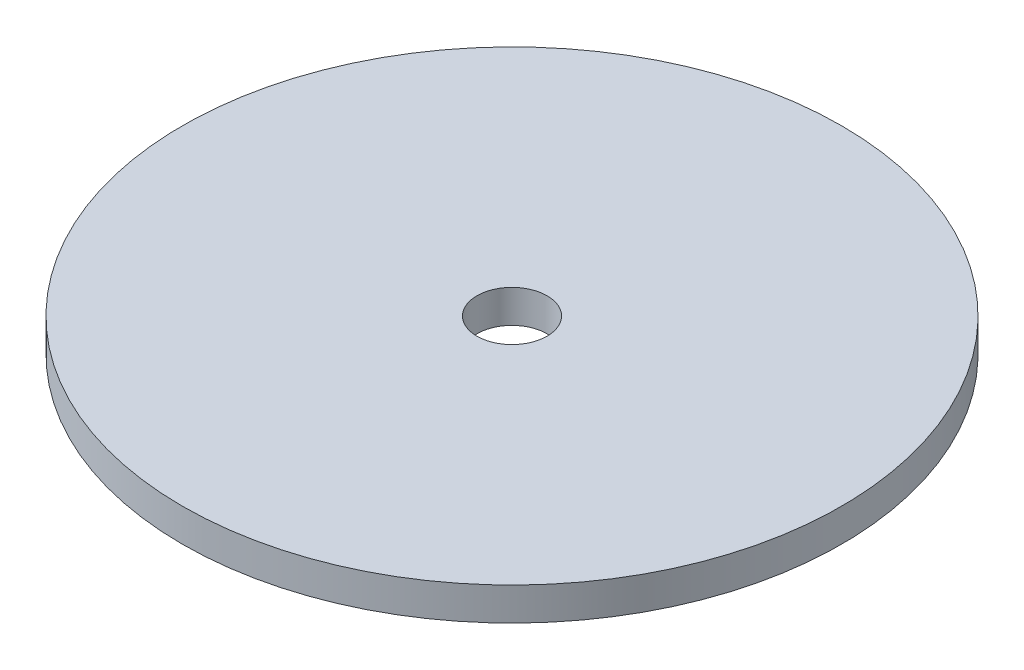
ISO-10303-21;
HEADER;
FILE_DESCRIPTION(('STEP AP214'),'2;1');
FILE_NAME('part.step','',(''),(''),'','','');
FILE_SCHEMA(('AUTOMOTIVE_DESIGN { 1 0 10303 214 1 1 1 1 }'));
ENDSEC;
DATA;
#1=APPLICATION_CONTEXT('core data for automotive mechanical design processes');
#2=APPLICATION_PROTOCOL_DEFINITION('international standard','automotive_design',2000,#1);
#3=PRODUCT_CONTEXT('',#1,'mechanical');
#4=PRODUCT('Part','Part','',(#3));
#5=PRODUCT_RELATED_PRODUCT_CATEGORY('part','',(#4));
#6=PRODUCT_DEFINITION_FORMATION('','',#4);
#7=PRODUCT_DEFINITION_CONTEXT('part definition',#1,'design');
#8=PRODUCT_DEFINITION('design','',#6,#7);
#9=PRODUCT_DEFINITION_SHAPE('','',#8);
#10=(LENGTH_UNIT() NAMED_UNIT(*) SI_UNIT(.MILLI.,.METRE.));
#11=(NAMED_UNIT(*) PLANE_ANGLE_UNIT() SI_UNIT($,.RADIAN.));
#12=(NAMED_UNIT(*) SI_UNIT($,.STERADIAN.) SOLID_ANGLE_UNIT());
#13=UNCERTAINTY_MEASURE_WITH_UNIT(LENGTH_MEASURE(1.E-05),#10,'distance_accuracy_value','');
#14=(GEOMETRIC_REPRESENTATION_CONTEXT(3) GLOBAL_UNCERTAINTY_ASSIGNED_CONTEXT((#13)) GLOBAL_UNIT_ASSIGNED_CONTEXT((#10,
#11,#12)) REPRESENTATION_CONTEXT('',''));
#15=CARTESIAN_POINT('',(0.,0.,0.));
#16=DIRECTION('',(0.,0.,1.));
#17=DIRECTION('',(1.,0.,0.));
#18=AXIS2_PLACEMENT_3D('',#15,#16,#17);
#19=CARTESIAN_POINT('',(0.,1.5875,0.));
#20=DIRECTION('',(0.,-1.,0.));
#21=DIRECTION('',(0.,0.,-1.));
#22=AXIS2_PLACEMENT_3D('',#19,#20,#21);
#23=CYLINDRICAL_SURFACE('',#22,31.75);
#24=CARTESIAN_POINT('',(0.,1.5875,0.));
#25=DIRECTION('',(0.,1.,0.));
#26=DIRECTION('',(0.,0.,1.));
#27=AXIS2_PLACEMENT_3D('',#24,#25,#26);
#28=CIRCLE('',#27,31.75);
#29=CARTESIAN_POINT('',(0.,1.5875,31.75));
#30=VERTEX_POINT('',#29);
#31=EDGE_CURVE('E10',#30,#30,#28,.T.);
#32=ORIENTED_EDGE('',*,*,#31,.F.);
#33=EDGE_LOOP('',(#32));
#34=FACE_BOUND('',#33,.T.);
#35=CARTESIAN_POINT('',(0.,-1.5875,0.));
#36=DIRECTION('',(0.,1.,0.));
#37=DIRECTION('',(0.,0.,1.));
#38=AXIS2_PLACEMENT_3D('',#35,#36,#37);
#39=CIRCLE('',#38,31.75);
#40=CARTESIAN_POINT('',(0.,-1.5875,31.75));
#41=VERTEX_POINT('',#40);
#42=EDGE_CURVE('E42',#41,#41,#39,.T.);
#43=ORIENTED_EDGE('',*,*,#42,.T.);
#44=EDGE_LOOP('',(#43));
#45=FACE_BOUND('',#44,.T.);
#46=ADVANCED_FACE('F39',(#34,#45),#23,.T.);
#47=CARTESIAN_POINT('',(0.,1.5875,0.));
#48=DIRECTION('',(0.,1.,0.));
#49=DIRECTION('',(0.,0.,1.));
#50=AXIS2_PLACEMENT_3D('',#47,#48,#49);
#51=PLANE('',#50);
#52=CARTESIAN_POINT('',(0.,1.5875,0.));
#53=DIRECTION('',(0.,1.,0.));
#54=DIRECTION('',(0.,0.,1.));
#55=AXIS2_PLACEMENT_3D('',#52,#53,#54);
#56=CIRCLE('',#55,3.3782);
#57=CARTESIAN_POINT('',(0.,1.5875,3.3782));
#58=VERTEX_POINT('',#57);
#59=EDGE_CURVE('E53',#58,#58,#56,.T.);
#60=ORIENTED_EDGE('',*,*,#59,.F.);
#61=EDGE_LOOP('',(#60));
#62=FACE_BOUND('',#61,.T.);
#63=ORIENTED_EDGE('',*,*,#31,.T.);
#64=EDGE_LOOP('',(#63));
#65=FACE_BOUND('',#64,.T.);
#66=ADVANCED_FACE('F70',(#62,#65),#51,.T.);
#67=CARTESIAN_POINT('',(0.,-1.5875,0.));
#68=DIRECTION('',(0.,1.,0.));
#69=DIRECTION('',(0.,0.,1.));
#70=AXIS2_PLACEMENT_3D('',#67,#68,#69);
#71=PLANE('',#70);
#72=CARTESIAN_POINT('',(0.,-1.5875,0.));
#73=DIRECTION('',(0.,1.,0.));
#74=DIRECTION('',(0.,0.,1.));
#75=AXIS2_PLACEMENT_3D('',#72,#73,#74);
#76=CIRCLE('',#75,3.3782);
#77=CARTESIAN_POINT('',(0.,-1.5875,3.3782));
#78=VERTEX_POINT('',#77);
#79=EDGE_CURVE('E51',#78,#78,#76,.T.);
#80=ORIENTED_EDGE('',*,*,#79,.T.);
#81=EDGE_LOOP('',(#80));
#82=FACE_BOUND('',#81,.T.);
#83=ORIENTED_EDGE('',*,*,#42,.F.);
#84=EDGE_LOOP('',(#83));
#85=FACE_BOUND('',#84,.T.);
#86=ADVANCED_FACE('F61',(#82,#85),#71,.F.);
#87=CARTESIAN_POINT('',(0.,-1.5875,0.));
#88=DIRECTION('',(0.,1.,0.));
#89=DIRECTION('',(0.,0.,1.));
#90=AXIS2_PLACEMENT_3D('',#87,#88,#89);
#91=CYLINDRICAL_SURFACE('',#90,3.3782);
#92=ORIENTED_EDGE('',*,*,#79,.F.);
#93=EDGE_LOOP('',(#92));
#94=FACE_BOUND('',#93,.T.);
#95=ORIENTED_EDGE('',*,*,#59,.T.);
#96=EDGE_LOOP('',(#95));
#97=FACE_BOUND('',#96,.T.);
#98=ADVANCED_FACE('F64',(#94,#97),#91,.F.);
#99=CLOSED_SHELL('',(#46,#66,#86,#98));
#100=MANIFOLD_SOLID_BREP('B2',#99);
#101=ADVANCED_BREP_SHAPE_REPRESENTATION('',(#18,#100),#14);
#102=SHAPE_DEFINITION_REPRESENTATION(#9,#101);
ENDSEC;
END-ISO-10303-21;
